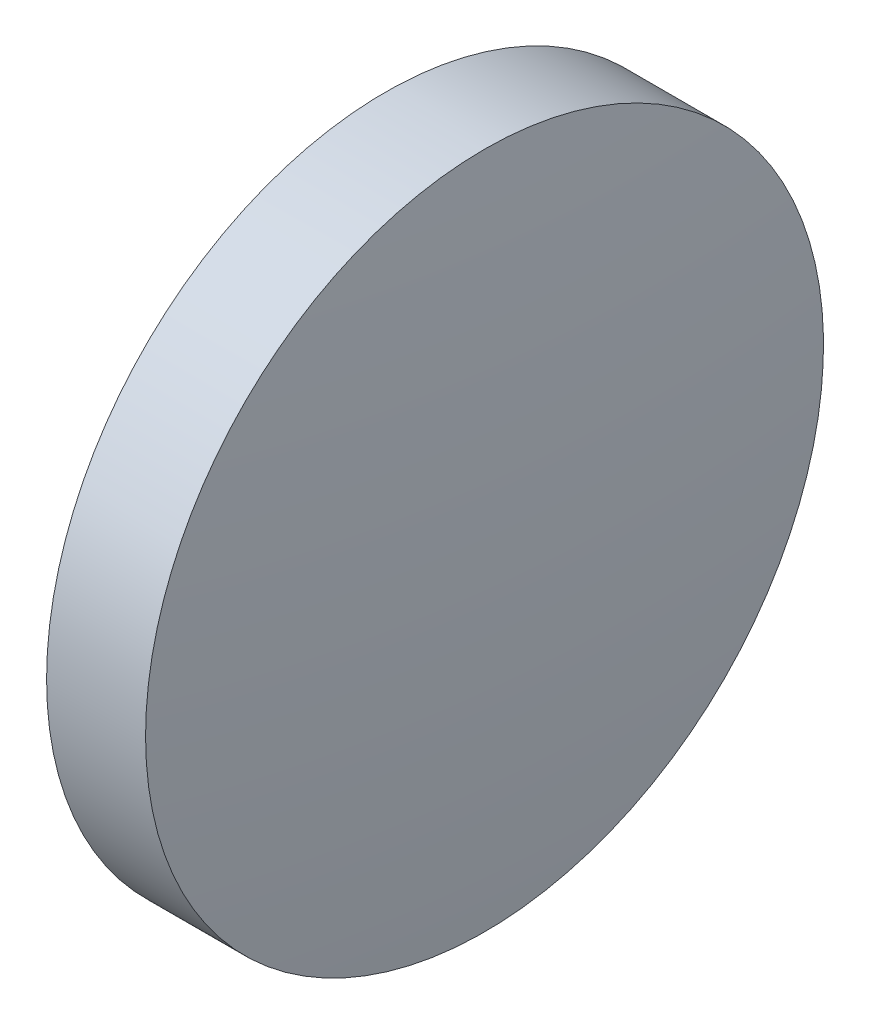
ISO-10303-21;
HEADER;
FILE_DESCRIPTION(('STEP AP214'),'2;1');
FILE_NAME('part.step','',(''),(''),'','','');
FILE_SCHEMA(('AUTOMOTIVE_DESIGN { 1 0 10303 214 1 1 1 1 }'));
ENDSEC;
DATA;
#1=APPLICATION_CONTEXT('core data for automotive mechanical design processes');
#2=APPLICATION_PROTOCOL_DEFINITION('international standard','automotive_design',2000,#1);
#3=PRODUCT_CONTEXT('',#1,'mechanical');
#4=PRODUCT('Part','Part','',(#3));
#5=PRODUCT_RELATED_PRODUCT_CATEGORY('part','',(#4));
#6=PRODUCT_DEFINITION_FORMATION('','',#4);
#7=PRODUCT_DEFINITION_CONTEXT('part definition',#1,'design');
#8=PRODUCT_DEFINITION('design','',#6,#7);
#9=PRODUCT_DEFINITION_SHAPE('','',#8);
#10=(LENGTH_UNIT() NAMED_UNIT(*) SI_UNIT(.MILLI.,.METRE.));
#11=(NAMED_UNIT(*) PLANE_ANGLE_UNIT() SI_UNIT($,.RADIAN.));
#12=(NAMED_UNIT(*) SI_UNIT($,.STERADIAN.) SOLID_ANGLE_UNIT());
#13=UNCERTAINTY_MEASURE_WITH_UNIT(LENGTH_MEASURE(1.E-05),#10,'distance_accuracy_value','');
#14=(GEOMETRIC_REPRESENTATION_CONTEXT(3) GLOBAL_UNCERTAINTY_ASSIGNED_CONTEXT((#13)) GLOBAL_UNIT_ASSIGNED_CONTEXT((#10,
#11,#12)) REPRESENTATION_CONTEXT('',''));
#15=CARTESIAN_POINT('',(0.,0.,0.));
#16=DIRECTION('',(0.,0.,1.));
#17=DIRECTION('',(1.,0.,0.));
#18=AXIS2_PLACEMENT_3D('',#15,#16,#17);
#19=CARTESIAN_POINT('',(372.422207616113,168.369281414703,0.));
#20=DIRECTION('',(-1.,0.,0.));
#21=DIRECTION('',(0.,1.,0.));
#22=AXIS2_PLACEMENT_3D('',#19,#20,#21);
#23=SPHERICAL_SURFACE('',#22,52.2033333333333);
#24=CARTESIAN_POINT('',(424.385540949446,168.369281414703,0.));
#25=DIRECTION('',(-1.,0.,0.));
#26=DIRECTION('',(0.,0.,1.));
#27=AXIS2_PLACEMENT_3D('',#24,#25,#26);
#28=CIRCLE('',#27,5.);
#29=CARTESIAN_POINT('',(424.385540949446,168.369281414703,5.));
#30=VERTEX_POINT('',#29);
#31=EDGE_CURVE('E10',#30,#30,#28,.T.);
#32=ORIENTED_EDGE('',*,*,#31,.F.);
#33=EDGE_LOOP('',(#32));
#34=FACE_BOUND('',#33,.T.);
#35=ADVANCED_FACE('F35',(#34),#23,.T.);
#36=CARTESIAN_POINT('',(421.983990477672,168.369281414703,0.));
#37=DIRECTION('',(-1.,0.,0.));
#38=DIRECTION('',(0.,0.,1.));
#39=AXIS2_PLACEMENT_3D('',#36,#37,#38);
#40=CYLINDRICAL_SURFACE('',#39,5.);
#41=CARTESIAN_POINT('',(422.925540949446,168.369281414703,0.));
#42=DIRECTION('',(-1.,0.,0.));
#43=DIRECTION('',(0.,0.,1.));
#44=AXIS2_PLACEMENT_3D('',#41,#42,#43);
#45=CIRCLE('',#44,5.);
#46=CARTESIAN_POINT('',(422.925540949446,168.369281414703,5.));
#47=VERTEX_POINT('',#46);
#48=EDGE_CURVE('E41',#47,#47,#45,.T.);
#49=ORIENTED_EDGE('',*,*,#48,.F.);
#50=EDGE_LOOP('',(#49));
#51=FACE_BOUND('',#50,.T.);
#52=ORIENTED_EDGE('',*,*,#31,.T.);
#53=EDGE_LOOP('',(#52));
#54=FACE_BOUND('',#53,.T.);
#55=ADVANCED_FACE('F49',(#51,#54),#40,.T.);
#56=CARTESIAN_POINT('',(422.925540949446,168.369281414703,0.));
#57=DIRECTION('',(1.,0.,0.));
#58=DIRECTION('',(0.,0.,-1.));
#59=AXIS2_PLACEMENT_3D('',#56,#57,#58);
#60=PLANE('',#59);
#61=ORIENTED_EDGE('',*,*,#48,.T.);
#62=EDGE_LOOP('',(#61));
#63=FACE_BOUND('',#62,.T.);
#64=ADVANCED_FACE('F47',(#63),#60,.F.);
#65=CLOSED_SHELL('',(#35,#55,#64));
#66=MANIFOLD_SOLID_BREP('B2',#65);
#67=ADVANCED_BREP_SHAPE_REPRESENTATION('',(#18,#66),#14);
#68=SHAPE_DEFINITION_REPRESENTATION(#9,#67);
ENDSEC;
END-ISO-10303-21;
